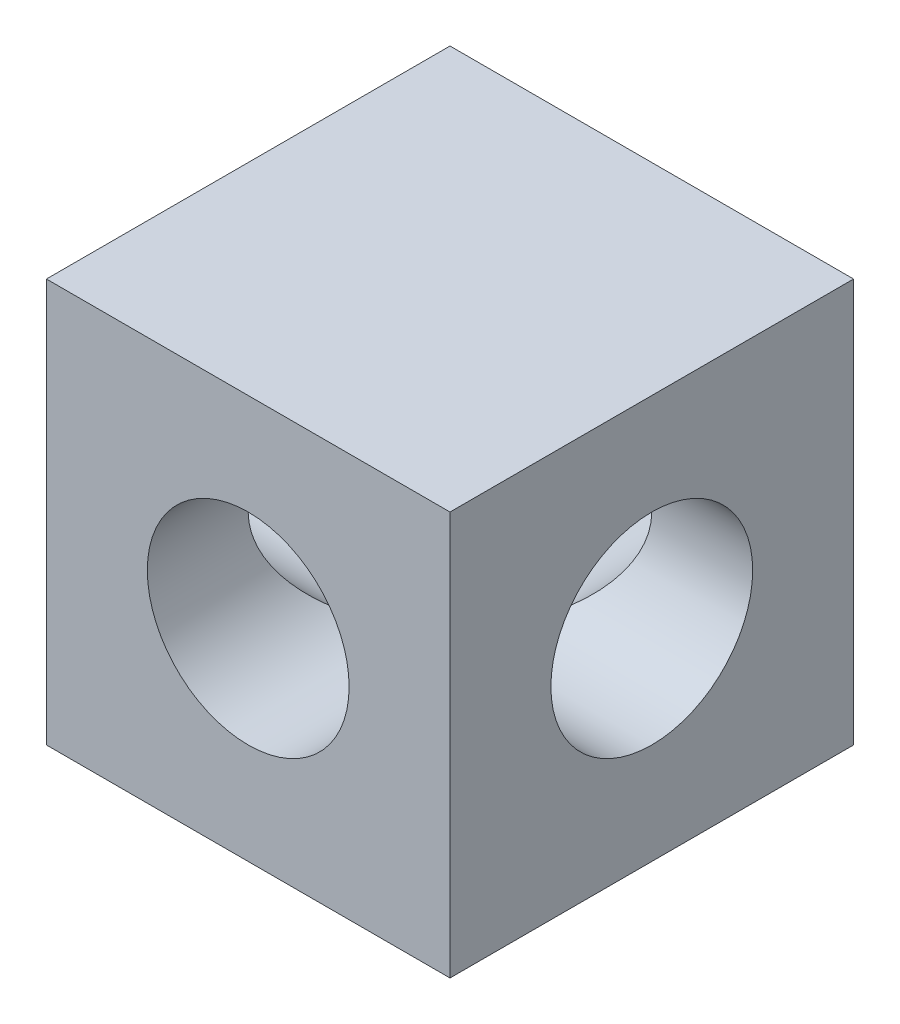
ISO-10303-21;
HEADER;
FILE_DESCRIPTION(('STEP AP214'),'2;1');
FILE_NAME('part.step','',(''),(''),'','','');
FILE_SCHEMA(('AUTOMOTIVE_DESIGN { 1 0 10303 214 1 1 1 1 }'));
ENDSEC;
DATA;
#1=APPLICATION_CONTEXT('core data for automotive mechanical design processes');
#2=APPLICATION_PROTOCOL_DEFINITION('international standard','automotive_design',2000,#1);
#3=PRODUCT_CONTEXT('',#1,'mechanical');
#4=PRODUCT('Part','Part','',(#3));
#5=PRODUCT_RELATED_PRODUCT_CATEGORY('part','',(#4));
#6=PRODUCT_DEFINITION_FORMATION('','',#4);
#7=PRODUCT_DEFINITION_CONTEXT('part definition',#1,'design');
#8=PRODUCT_DEFINITION('design','',#6,#7);
#9=PRODUCT_DEFINITION_SHAPE('','',#8);
#10=(LENGTH_UNIT() NAMED_UNIT(*) SI_UNIT(.MILLI.,.METRE.));
#11=(NAMED_UNIT(*) PLANE_ANGLE_UNIT() SI_UNIT($,.RADIAN.));
#12=(NAMED_UNIT(*) SI_UNIT($,.STERADIAN.) SOLID_ANGLE_UNIT());
#13=UNCERTAINTY_MEASURE_WITH_UNIT(LENGTH_MEASURE(1.E-05),#10,'distance_accuracy_value','');
#14=(GEOMETRIC_REPRESENTATION_CONTEXT(3) GLOBAL_UNCERTAINTY_ASSIGNED_CONTEXT((#13)) GLOBAL_UNIT_ASSIGNED_CONTEXT((#10,
#11,#12)) REPRESENTATION_CONTEXT('',''));
#15=CARTESIAN_POINT('',(0.,0.,0.));
#16=DIRECTION('',(0.,0.,1.));
#17=DIRECTION('',(1.,0.,0.));
#18=AXIS2_PLACEMENT_3D('',#15,#16,#17);
#19=CARTESIAN_POINT('',(0.,0.,9.525));
#20=DIRECTION('',(0.,0.,-1.));
#21=DIRECTION('',(-1.,0.,0.));
#22=AXIS2_PLACEMENT_3D('',#19,#20,#21);
#23=CYLINDRICAL_SURFACE('',#22,4.7625);
#24=CARTESIAN_POINT('',(0.,0.,0.));
#25=DIRECTION('',(0.707106781186548,0.,-0.707106781186547));
#26=DIRECTION('',(-0.707106781186548,0.,-0.707106781186547));
#27=AXIS2_PLACEMENT_3D('',#24,#25,#26);
#28=ELLIPSE('',#27,6.73519209080187,4.7625);
#29=CARTESIAN_POINT('',(0.,-4.7625,0.));
#30=VERTEX_POINT('',#29);
#31=CARTESIAN_POINT('',(0.,4.7625,0.));
#32=VERTEX_POINT('',#31);
#33=EDGE_CURVE('E11',#30,#32,#28,.F.);
#34=ORIENTED_EDGE('',*,*,#33,.F.);
#35=CARTESIAN_POINT('',(0.,0.,0.));
#36=DIRECTION('',(-0.707106781186548,0.,-0.707106781186547));
#37=DIRECTION('',(0.707106781186548,0.,-0.707106781186547));
#38=AXIS2_PLACEMENT_3D('',#35,#36,#37);
#39=ELLIPSE('',#38,6.73519209080187,4.7625);
#40=EDGE_CURVE('E58',#32,#30,#39,.F.);
#41=ORIENTED_EDGE('',*,*,#40,.F.);
#42=EDGE_LOOP('',(#34,#41));
#43=FACE_BOUND('',#42,.T.);
#44=CARTESIAN_POINT('',(0.,0.,9.525));
#45=DIRECTION('',(0.,0.,1.));
#46=DIRECTION('',(1.,0.,0.));
#47=AXIS2_PLACEMENT_3D('',#44,#45,#46);
#48=CIRCLE('',#47,4.7625);
#49=CARTESIAN_POINT('',(4.7625,0.,9.525));
#50=VERTEX_POINT('',#49);
#51=EDGE_CURVE('E154',#50,#50,#48,.T.);
#52=ORIENTED_EDGE('',*,*,#51,.T.);
#53=EDGE_LOOP('',(#52));
#54=FACE_BOUND('',#53,.T.);
#55=ADVANCED_FACE('F40',(#43,#54),#23,.F.);
#56=CARTESIAN_POINT('',(-9.525,-9.525,9.525));
#57=DIRECTION('',(0.,0.,-1.));
#58=DIRECTION('',(-1.,0.,0.));
#59=AXIS2_PLACEMENT_3D('',#56,#57,#58);
#60=PLANE('',#59);
#61=DIRECTION('',(0.,1.,0.));
#62=VECTOR('',#61,1.);
#63=CARTESIAN_POINT('',(-9.525,-9.525,9.525));
#64=LINE('',#63,#62);
#65=CARTESIAN_POINT('',(-9.525,-9.525,9.525));
#66=VERTEX_POINT('',#65);
#67=CARTESIAN_POINT('',(-9.525,9.525,9.525));
#68=VERTEX_POINT('',#67);
#69=EDGE_CURVE('E141',#66,#68,#64,.T.);
#70=ORIENTED_EDGE('',*,*,#69,.F.);
#71=DIRECTION('',(1.,0.,0.));
#72=VECTOR('',#71,1.);
#73=CARTESIAN_POINT('',(-9.525,-9.525,9.525));
#74=LINE('',#73,#72);
#75=CARTESIAN_POINT('',(9.525,-9.525,9.525));
#76=VERTEX_POINT('',#75);
#77=EDGE_CURVE('E130',#66,#76,#74,.T.);
#78=ORIENTED_EDGE('',*,*,#77,.T.);
#79=DIRECTION('',(0.,-1.,0.));
#80=VECTOR('',#79,1.);
#81=CARTESIAN_POINT('',(9.525,9.525,9.525));
#82=LINE('',#81,#80);
#83=CARTESIAN_POINT('',(9.525,9.525,9.525));
#84=VERTEX_POINT('',#83);
#85=EDGE_CURVE('E157',#84,#76,#82,.T.);
#86=ORIENTED_EDGE('',*,*,#85,.F.);
#87=DIRECTION('',(-1.,0.,0.));
#88=VECTOR('',#87,1.);
#89=CARTESIAN_POINT('',(9.525,9.525,9.525));
#90=LINE('',#89,#88);
#91=EDGE_CURVE('E100',#84,#68,#90,.T.);
#92=ORIENTED_EDGE('',*,*,#91,.T.);
#93=EDGE_LOOP('',(#70,#78,#86,#92));
#94=FACE_BOUND('',#93,.T.);
#95=ORIENTED_EDGE('',*,*,#51,.F.);
#96=EDGE_LOOP('',(#95));
#97=FACE_BOUND('',#96,.T.);
#98=ADVANCED_FACE('F189',(#94,#97),#60,.F.);
#99=CARTESIAN_POINT('',(-9.525,-9.525,-9.525));
#100=DIRECTION('',(0.,0.,-1.));
#101=DIRECTION('',(-1.,0.,0.));
#102=AXIS2_PLACEMENT_3D('',#99,#100,#101);
#103=PLANE('',#102);
#104=DIRECTION('',(0.,1.,0.));
#105=VECTOR('',#104,1.);
#106=CARTESIAN_POINT('',(-9.525,-9.525,-9.525));
#107=LINE('',#106,#105);
#108=CARTESIAN_POINT('',(-9.525,-9.525,-9.525));
#109=VERTEX_POINT('',#108);
#110=CARTESIAN_POINT('',(-9.525,9.525,-9.525));
#111=VERTEX_POINT('',#110);
#112=EDGE_CURVE('E150',#109,#111,#107,.T.);
#113=ORIENTED_EDGE('',*,*,#112,.T.);
#114=DIRECTION('',(-1.,0.,0.));
#115=VECTOR('',#114,1.);
#116=CARTESIAN_POINT('',(9.525,9.525,-9.525));
#117=LINE('',#116,#115);
#118=CARTESIAN_POINT('',(9.525,9.525,-9.525));
#119=VERTEX_POINT('',#118);
#120=EDGE_CURVE('E146',#119,#111,#117,.T.);
#121=ORIENTED_EDGE('',*,*,#120,.F.);
#122=DIRECTION('',(0.,-1.,0.));
#123=VECTOR('',#122,1.);
#124=CARTESIAN_POINT('',(9.525,9.525,-9.525));
#125=LINE('',#124,#123);
#126=CARTESIAN_POINT('',(9.525,-9.525,-9.525));
#127=VERTEX_POINT('',#126);
#128=EDGE_CURVE('E142',#119,#127,#125,.T.);
#129=ORIENTED_EDGE('',*,*,#128,.T.);
#130=DIRECTION('',(1.,0.,0.));
#131=VECTOR('',#130,1.);
#132=CARTESIAN_POINT('',(-9.525,-9.525,-9.525));
#133=LINE('',#132,#131);
#134=EDGE_CURVE('E138',#109,#127,#133,.T.);
#135=ORIENTED_EDGE('',*,*,#134,.F.);
#136=EDGE_LOOP('',(#113,#121,#129,#135));
#137=FACE_BOUND('',#136,.T.);
#138=CARTESIAN_POINT('',(0.,0.,-9.525));
#139=DIRECTION('',(0.,0.,1.));
#140=DIRECTION('',(1.,0.,0.));
#141=AXIS2_PLACEMENT_3D('',#138,#139,#140);
#142=CIRCLE('',#141,4.7625);
#143=CARTESIAN_POINT('',(4.7625,0.,-9.525));
#144=VERTEX_POINT('',#143);
#145=EDGE_CURVE('E165',#144,#144,#142,.T.);
#146=ORIENTED_EDGE('',*,*,#145,.T.);
#147=EDGE_LOOP('',(#146));
#148=FACE_BOUND('',#147,.T.);
#149=ADVANCED_FACE('F193',(#137,#148),#103,.T.);
#150=CARTESIAN_POINT('',(-9.525,-9.525,9.525));
#151=DIRECTION('',(-1.,0.,0.));
#152=DIRECTION('',(0.,-1.,0.));
#153=AXIS2_PLACEMENT_3D('',#150,#151,#152);
#154=PLANE('',#153);
#155=CARTESIAN_POINT('',(-9.525,0.,0.));
#156=DIRECTION('',(1.,0.,0.));
#157=DIRECTION('',(0.,0.,-1.));
#158=AXIS2_PLACEMENT_3D('',#155,#156,#157);
#159=CIRCLE('',#158,4.7625);
#160=CARTESIAN_POINT('',(-9.525,0.,-4.7625));
#161=VERTEX_POINT('',#160);
#162=EDGE_CURVE('E169',#161,#161,#159,.T.);
#163=ORIENTED_EDGE('',*,*,#162,.T.);
#164=EDGE_LOOP('',(#163));
#165=FACE_BOUND('',#164,.T.);
#166=ORIENTED_EDGE('',*,*,#112,.F.);
#167=DIRECTION('',(0.,0.,-1.));
#168=VECTOR('',#167,1.);
#169=CARTESIAN_POINT('',(-9.525,-9.525,9.525));
#170=LINE('',#169,#168);
#171=EDGE_CURVE('E68',#66,#109,#170,.T.);
#172=ORIENTED_EDGE('',*,*,#171,.F.);
#173=ORIENTED_EDGE('',*,*,#69,.T.);
#174=DIRECTION('',(0.,0.,-1.));
#175=VECTOR('',#174,1.);
#176=CARTESIAN_POINT('',(-9.525,9.525,9.525));
#177=LINE('',#176,#175);
#178=EDGE_CURVE('E126',#68,#111,#177,.T.);
#179=ORIENTED_EDGE('',*,*,#178,.T.);
#180=EDGE_LOOP('',(#166,#172,#173,#179));
#181=FACE_BOUND('',#180,.T.);
#182=ADVANCED_FACE('F42',(#165,#181),#154,.T.);
#183=CARTESIAN_POINT('',(-9.525,-9.525,9.525));
#184=DIRECTION('',(0.,1.,0.));
#185=DIRECTION('',(-1.,0.,0.));
#186=AXIS2_PLACEMENT_3D('',#183,#184,#185);
#187=PLANE('',#186);
#188=ORIENTED_EDGE('',*,*,#134,.T.);
#189=DIRECTION('',(0.,0.,-1.));
#190=VECTOR('',#189,1.);
#191=CARTESIAN_POINT('',(9.525,-9.525,9.525));
#192=LINE('',#191,#190);
#193=EDGE_CURVE('E133',#76,#127,#192,.T.);
#194=ORIENTED_EDGE('',*,*,#193,.F.);
#195=ORIENTED_EDGE('',*,*,#77,.F.);
#196=ORIENTED_EDGE('',*,*,#171,.T.);
#197=EDGE_LOOP('',(#188,#194,#195,#196));
#198=FACE_BOUND('',#197,.T.);
#199=ADVANCED_FACE('F199',(#198),#187,.F.);
#200=CARTESIAN_POINT('',(9.525,9.525,9.525));
#201=DIRECTION('',(1.,0.,0.));
#202=DIRECTION('',(0.,1.,0.));
#203=AXIS2_PLACEMENT_3D('',#200,#201,#202);
#204=PLANE('',#203);
#205=CARTESIAN_POINT('',(9.525,0.,0.));
#206=DIRECTION('',(1.,0.,0.));
#207=DIRECTION('',(0.,0.,-1.));
#208=AXIS2_PLACEMENT_3D('',#205,#206,#207);
#209=CIRCLE('',#208,4.7625);
#210=CARTESIAN_POINT('',(9.525,0.,-4.7625));
#211=VERTEX_POINT('',#210);
#212=EDGE_CURVE('E172',#211,#211,#209,.T.);
#213=ORIENTED_EDGE('',*,*,#212,.F.);
#214=EDGE_LOOP('',(#213));
#215=FACE_BOUND('',#214,.T.);
#216=ORIENTED_EDGE('',*,*,#128,.F.);
#217=DIRECTION('',(0.,0.,-1.));
#218=VECTOR('',#217,1.);
#219=CARTESIAN_POINT('',(9.525,9.525,9.525));
#220=LINE('',#219,#218);
#221=EDGE_CURVE('E129',#84,#119,#220,.T.);
#222=ORIENTED_EDGE('',*,*,#221,.F.);
#223=ORIENTED_EDGE('',*,*,#85,.T.);
#224=ORIENTED_EDGE('',*,*,#193,.T.);
#225=EDGE_LOOP('',(#216,#222,#223,#224));
#226=FACE_BOUND('',#225,.T.);
#227=ADVANCED_FACE('F202',(#215,#226),#204,.T.);
#228=CARTESIAN_POINT('',(9.525,9.525,9.525));
#229=DIRECTION('',(0.,-1.,0.));
#230=DIRECTION('',(1.,0.,0.));
#231=AXIS2_PLACEMENT_3D('',#228,#229,#230);
#232=PLANE('',#231);
#233=ORIENTED_EDGE('',*,*,#120,.T.);
#234=ORIENTED_EDGE('',*,*,#178,.F.);
#235=ORIENTED_EDGE('',*,*,#91,.F.);
#236=ORIENTED_EDGE('',*,*,#221,.T.);
#237=EDGE_LOOP('',(#233,#234,#235,#236));
#238=FACE_BOUND('',#237,.T.);
#239=ADVANCED_FACE('F186',(#238),#232,.F.);
#240=CARTESIAN_POINT('',(0.,0.,0.));
#241=DIRECTION('',(0.707106781186548,0.,-0.707106781186547));
#242=DIRECTION('',(-0.707106781186548,0.,-0.707106781186547));
#243=AXIS2_PLACEMENT_3D('',#240,#241,#242);
#244=ELLIPSE('',#243,6.73519209080187,4.7625);
#245=EDGE_CURVE('E49',#30,#32,#244,.T.);
#246=ORIENTED_EDGE('',*,*,#245,.F.);
#247=CARTESIAN_POINT('',(0.,0.,0.));
#248=DIRECTION('',(-0.707106781186548,0.,-0.707106781186547));
#249=DIRECTION('',(0.707106781186548,0.,-0.707106781186547));
#250=AXIS2_PLACEMENT_3D('',#247,#248,#249);
#251=ELLIPSE('',#250,6.73519209080187,4.7625);
#252=EDGE_CURVE('E108',#32,#30,#251,.T.);
#253=ORIENTED_EDGE('',*,*,#252,.F.);
#254=EDGE_LOOP('',(#246,#253));
#255=FACE_BOUND('',#254,.T.);
#256=ORIENTED_EDGE('',*,*,#145,.F.);
#257=EDGE_LOOP('',(#256));
#258=FACE_BOUND('',#257,.T.);
#259=ADVANCED_FACE('F121',(#255,#258),#23,.F.);
#260=CARTESIAN_POINT('',(-9.525,0.,0.));
#261=DIRECTION('',(1.,0.,0.));
#262=DIRECTION('',(0.,0.,-1.));
#263=AXIS2_PLACEMENT_3D('',#260,#261,#262);
#264=CYLINDRICAL_SURFACE('',#263,4.7625);
#265=ORIENTED_EDGE('',*,*,#245,.T.);
#266=ORIENTED_EDGE('',*,*,#40,.T.);
#267=EDGE_LOOP('',(#265,#266));
#268=FACE_BOUND('',#267,.T.);
#269=ORIENTED_EDGE('',*,*,#162,.F.);
#270=EDGE_LOOP('',(#269));
#271=FACE_BOUND('',#270,.T.);
#272=ADVANCED_FACE('F116',(#268,#271),#264,.F.);
#273=ORIENTED_EDGE('',*,*,#33,.T.);
#274=ORIENTED_EDGE('',*,*,#252,.T.);
#275=EDGE_LOOP('',(#273,#274));
#276=FACE_BOUND('',#275,.T.);
#277=ORIENTED_EDGE('',*,*,#212,.T.);
#278=EDGE_LOOP('',(#277));
#279=FACE_BOUND('',#278,.T.);
#280=ADVANCED_FACE('F109',(#276,#279),#264,.F.);
#281=CLOSED_SHELL('',(#55,#98,#149,#182,#199,#227,#239,#259,#272,#280));
#282=MANIFOLD_SOLID_BREP('B2',#281);
#283=ADVANCED_BREP_SHAPE_REPRESENTATION('',(#18,#282),#14);
#284=SHAPE_DEFINITION_REPRESENTATION(#9,#283);
ENDSEC;
END-ISO-10303-21;
